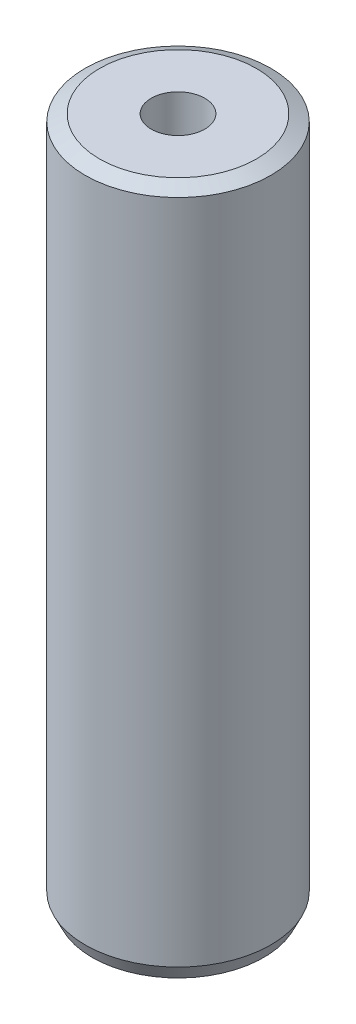
ISO-10303-21;
HEADER;
FILE_DESCRIPTION(('STEP AP214'),'2;1');
FILE_NAME('part.step','',(''),(''),'','','');
FILE_SCHEMA(('AUTOMOTIVE_DESIGN { 1 0 10303 214 1 1 1 1 }'));
ENDSEC;
DATA;
#1=APPLICATION_CONTEXT('core data for automotive mechanical design processes');
#2=APPLICATION_PROTOCOL_DEFINITION('international standard','automotive_design',2000,#1);
#3=PRODUCT_CONTEXT('',#1,'mechanical');
#4=PRODUCT('Part','Part','',(#3));
#5=PRODUCT_RELATED_PRODUCT_CATEGORY('part','',(#4));
#6=PRODUCT_DEFINITION_FORMATION('','',#4);
#7=PRODUCT_DEFINITION_CONTEXT('part definition',#1,'design');
#8=PRODUCT_DEFINITION('design','',#6,#7);
#9=PRODUCT_DEFINITION_SHAPE('','',#8);
#10=(LENGTH_UNIT() NAMED_UNIT(*) SI_UNIT(.MILLI.,.METRE.));
#11=(NAMED_UNIT(*) PLANE_ANGLE_UNIT() SI_UNIT($,.RADIAN.));
#12=(NAMED_UNIT(*) SI_UNIT($,.STERADIAN.) SOLID_ANGLE_UNIT());
#13=UNCERTAINTY_MEASURE_WITH_UNIT(LENGTH_MEASURE(1.E-05),#10,'distance_accuracy_value','');
#14=(GEOMETRIC_REPRESENTATION_CONTEXT(3) GLOBAL_UNCERTAINTY_ASSIGNED_CONTEXT((#13)) GLOBAL_UNIT_ASSIGNED_CONTEXT((#10,
#11,#12)) REPRESENTATION_CONTEXT('',''));
#15=CARTESIAN_POINT('',(0.,0.,0.));
#16=DIRECTION('',(0.,0.,1.));
#17=DIRECTION('',(1.,0.,0.));
#18=AXIS2_PLACEMENT_3D('',#15,#16,#17);
#19=CARTESIAN_POINT('',(0.,92.6308624534081,0.));
#20=DIRECTION('',(0.,-1.,0.));
#21=DIRECTION('',(0.,0.,-1.));
#22=AXIS2_PLACEMENT_3D('',#19,#20,#21);
#23=CYLINDRICAL_SURFACE('',#22,12.5);
#24=CARTESIAN_POINT('',(0.,91.688301292107,0.));
#25=DIRECTION('',(0.,1.,0.));
#26=DIRECTION('',(0.,0.,1.));
#27=AXIS2_PLACEMENT_3D('',#24,#25,#26);
#28=CIRCLE('',#27,12.5);
#29=CARTESIAN_POINT('',(0.,91.688301292107,-12.5));
#30=VERTEX_POINT('',#29);
#31=EDGE_CURVE('E50',#30,#30,#28,.F.);
#32=CARTESIAN_POINT('',(0.,1.93624141101131,0.));
#33=DIRECTION('',(0.,1.,0.));
#34=DIRECTION('',(0.,0.,1.));
#35=AXIS2_PLACEMENT_3D('',#32,#33,#34);
#36=CIRCLE('',#35,12.5);
#37=CARTESIAN_POINT('',(0.,1.9362414110113,-12.5));
#38=VERTEX_POINT('',#37);
#39=EDGE_CURVE('E51',#38,#38,#36,.T.);
#40=CARTESIAN_POINT('',(0.,91.688301292107,-12.5));
#41=CARTESIAN_POINT('',(0.,90.7533840016789,-12.5));
#42=CARTESIAN_POINT('',(0.,89.8184667112508,-12.5));
#43=CARTESIAN_POINT('',(0.,87.9486321303947,-12.5));
#44=CARTESIAN_POINT('',(0.,87.0137148399666,-12.5));
#45=CARTESIAN_POINT('',(0.,85.1438802591104,-12.5));
#46=CARTESIAN_POINT('',(0.,84.2089629686823,-12.5));
#47=CARTESIAN_POINT('',(0.,82.3391283878262,-12.5));
#48=CARTESIAN_POINT('',(0.,81.4042110973981,-12.5));
#49=CARTESIAN_POINT('',(0.,79.5343765165419,-12.5));
#50=CARTESIAN_POINT('',(0.,78.5994592261139,-12.5));
#51=CARTESIAN_POINT('',(0.,76.7296246452577,-12.5));
#52=CARTESIAN_POINT('',(0.,75.7947073548296,-12.5));
#53=CARTESIAN_POINT('',(0.,73.9248727739735,-12.5));
#54=CARTESIAN_POINT('',(0.,72.9899554835454,-12.5));
#55=CARTESIAN_POINT('',(0.,71.1201209026892,-12.5));
#56=CARTESIAN_POINT('',(0.,70.1852036122611,-12.5));
#57=CARTESIAN_POINT('',(0.,68.315369031405,-12.5));
#58=CARTESIAN_POINT('',(0.,67.3804517409769,-12.5));
#59=CARTESIAN_POINT('',(0.,65.5106171601207,-12.5));
#60=CARTESIAN_POINT('',(0.,64.5756998696927,-12.5));
#61=CARTESIAN_POINT('',(0.,62.7058652888365,-12.5));
#62=CARTESIAN_POINT('',(0.,61.7709479984084,-12.5));
#63=CARTESIAN_POINT('',(0.,59.9011134175523,-12.5));
#64=CARTESIAN_POINT('',(0.,58.9661961271242,-12.5));
#65=CARTESIAN_POINT('',(0.,57.096361546268,-12.5));
#66=CARTESIAN_POINT('',(0.,56.1614442558399,-12.5));
#67=CARTESIAN_POINT('',(0.,54.2916096749838,-12.5));
#68=CARTESIAN_POINT('',(0.,53.3566923845557,-12.5));
#69=CARTESIAN_POINT('',(0.,51.4868578036995,-12.5));
#70=CARTESIAN_POINT('',(0.,50.5519405132715,-12.5));
#71=CARTESIAN_POINT('',(0.,48.6821059324153,-12.5));
#72=CARTESIAN_POINT('',(0.,47.7471886419872,-12.5));
#73=CARTESIAN_POINT('',(0.,45.8773540611311,-12.5));
#74=CARTESIAN_POINT('',(0.,44.942436770703,-12.5));
#75=CARTESIAN_POINT('',(0.,43.0726021898468,-12.5));
#76=CARTESIAN_POINT('',(0.,42.1376848994187,-12.5));
#77=CARTESIAN_POINT('',(0.,40.2678503185626,-12.5));
#78=CARTESIAN_POINT('',(0.,39.3329330281345,-12.5));
#79=CARTESIAN_POINT('',(0.,37.4630984472783,-12.5));
#80=CARTESIAN_POINT('',(0.,36.5281811568503,-12.5));
#81=CARTESIAN_POINT('',(0.,34.6583465759941,-12.5));
#82=CARTESIAN_POINT('',(0.,33.723429285566,-12.5));
#83=CARTESIAN_POINT('',(0.,31.8535947047099,-12.5));
#84=CARTESIAN_POINT('',(0.,30.9186774142818,-12.5));
#85=CARTESIAN_POINT('',(0.,29.0488428334256,-12.5));
#86=CARTESIAN_POINT('',(0.,28.1139255429975,-12.5));
#87=CARTESIAN_POINT('',(0.,26.2440909621414,-12.5));
#88=CARTESIAN_POINT('',(0.,25.3091736717133,-12.5));
#89=CARTESIAN_POINT('',(0.,23.4393390908571,-12.5));
#90=CARTESIAN_POINT('',(0.,22.5044218004291,-12.5));
#91=CARTESIAN_POINT('',(0.,20.6345872195729,-12.5));
#92=CARTESIAN_POINT('',(0.,19.6996699291448,-12.5));
#93=CARTESIAN_POINT('',(0.,17.8298353482887,-12.5));
#94=CARTESIAN_POINT('',(0.,16.8949180578606,-12.5));
#95=CARTESIAN_POINT('',(0.,15.0250834770044,-12.5));
#96=CARTESIAN_POINT('',(0.,14.0901661865763,-12.5));
#97=CARTESIAN_POINT('',(0.,12.2203316057202,-12.5));
#98=CARTESIAN_POINT('',(0.,11.2854143152921,-12.5));
#99=CARTESIAN_POINT('',(0.,9.41557973443594,-12.5));
#100=CARTESIAN_POINT('',(0.,8.48066244400786,-12.5));
#101=CARTESIAN_POINT('',(0.,6.6108278631517,-12.5));
#102=CARTESIAN_POINT('',(0.,5.67591057272362,-12.5));
#103=CARTESIAN_POINT('',(0.,3.80607599186746,-12.5));
#104=CARTESIAN_POINT('',(0.,2.87115870143938,-12.5));
#105=CARTESIAN_POINT('',(0.,1.9362414110113,-12.5));
#106=B_SPLINE_CURVE_WITH_KNOTS('',3,(#40,#41,#42,#43,#44,#45,#46,#47,#48,#49,#50,#51,#52,#53,
#54,#55,#56,#57,#58,#59,#60,#61,#62,#63,#64,#65,#66,#67,#68,#69,#70,#71,#72,#73,#74,#75,#76,#77,
#78,#79,#80,#81,#82,#83,#84,#85,#86,#87,#88,#89,#90,#91,#92,#93,#94,#95,#96,#97,#98,#99,#100,
#101,#102,#103,#104,#105),.UNSPECIFIED.,.F.,.F.,(4,2,2,2,2,2,2,2,2,2,2,2,2,2,2,2,2,2,2,2,2,2,2,
2,2,2,2,2,2,2,2,2,4),(0.,2.80475187128423,5.60950374256847,8.41425561385271,11.2190074851369,
14.0237593564212,16.8285112277054,19.6332630989897,22.4380149702739,25.2427668415581,
28.0475187128424,30.8522705841266,33.6570224554109,36.4617743266951,39.2665261979793,
42.0712780692636,44.8760299405478,47.6807818118321,50.4855336831163,53.2902855544005,
56.0950374256848,58.899789296969,61.7045411682533,64.5092930395375,67.3140449108217,
70.118796782106,72.9235486533902,75.7283005246745,78.5330523959587,81.3378042672429,
84.1425561385272,86.9473080098114,89.7520598810957),.UNSPECIFIED.);
#107=EDGE_CURVE('BSEAM39',#30,#38,#106,.T.);
#108=ORIENTED_EDGE('',*,*,#31,.T.);
#109=ORIENTED_EDGE('',*,*,#39,.T.);
#110=ORIENTED_EDGE('',*,*,#107,.T.);
#111=ORIENTED_EDGE('',*,*,#107,.F.);
#112=EDGE_LOOP('',(#108,#110,#109,#111));
#113=FACE_BOUND('',#112,.T.);
#114=ADVANCED_FACE('F39',(#113),#23,.T.);
#115=CARTESIAN_POINT('',(0.,92.6308624534081,0.));
#116=DIRECTION('',(0.,1.,0.));
#117=DIRECTION('',(0.,0.,1.));
#118=AXIS2_PLACEMENT_3D('',#115,#116,#117);
#119=PLANE('',#118);
#120=CARTESIAN_POINT('',(0.,92.6308624534081,0.));
#121=DIRECTION('',(0.,1.,0.));
#122=DIRECTION('',(0.,0.,1.));
#123=AXIS2_PLACEMENT_3D('',#120,#121,#122);
#124=CIRCLE('',#123,10.563758588989);
#125=CARTESIAN_POINT('',(0.,92.6308624534081,10.563758588989));
#126=VERTEX_POINT('',#125);
#127=EDGE_CURVE('E54',#126,#126,#124,.T.);
#128=ORIENTED_EDGE('',*,*,#127,.T.);
#129=EDGE_LOOP('',(#128));
#130=FACE_BOUND('',#129,.T.);
#131=CARTESIAN_POINT('',(0.,92.6308624534081,0.));
#132=DIRECTION('',(0.,1.,0.));
#133=DIRECTION('',(0.,0.,1.));
#134=AXIS2_PLACEMENT_3D('',#131,#132,#133);
#135=CIRCLE('',#134,3.61154254292769);
#136=CARTESIAN_POINT('',(0.,92.6308624534081,-3.61154254292769));
#137=VERTEX_POINT('',#136);
#138=EDGE_CURVE('E58',#137,#137,#135,.T.);
#139=ORIENTED_EDGE('',*,*,#138,.F.);
#140=EDGE_LOOP('',(#139));
#141=FACE_BOUND('',#140,.T.);
#142=ADVANCED_FACE('F69',(#130,#141),#119,.T.);
#143=CARTESIAN_POINT('',(0.,0.,0.));
#144=DIRECTION('',(0.,1.,0.));
#145=DIRECTION('',(0.,0.,1.));
#146=AXIS2_PLACEMENT_3D('',#143,#144,#145);
#147=PLANE('',#146);
#148=CARTESIAN_POINT('',(0.,0.,0.));
#149=DIRECTION('',(0.,1.,0.));
#150=DIRECTION('',(0.,0.,1.));
#151=AXIS2_PLACEMENT_3D('',#148,#149,#150);
#152=CIRCLE('',#151,11.5574388386988);
#153=CARTESIAN_POINT('',(0.,0.,11.5574388386988));
#154=VERTEX_POINT('',#153);
#155=EDGE_CURVE('E10',#154,#154,#152,.F.);
#156=ORIENTED_EDGE('',*,*,#155,.T.);
#157=EDGE_LOOP('',(#156));
#158=FACE_BOUND('',#157,.T.);
#159=CARTESIAN_POINT('',(0.,0.,0.));
#160=DIRECTION('',(0.,1.,0.));
#161=DIRECTION('',(0.,0.,1.));
#162=AXIS2_PLACEMENT_3D('',#159,#160,#161);
#163=CIRCLE('',#162,3.61154254292769);
#164=CARTESIAN_POINT('',(0.,0.,-3.61154254292769));
#165=VERTEX_POINT('',#164);
#166=EDGE_CURVE('E63',#165,#165,#163,.T.);
#167=ORIENTED_EDGE('',*,*,#166,.T.);
#168=EDGE_LOOP('',(#167));
#169=FACE_BOUND('',#168,.T.);
#170=ADVANCED_FACE('F75',(#158,#169),#147,.F.);
#171=CARTESIAN_POINT('',(0.,92.6308624534081,0.));
#172=DIRECTION('',(0.,-1.,0.));
#173=DIRECTION('',(0.,0.,-1.));
#174=AXIS2_PLACEMENT_3D('',#171,#172,#173);
#175=CYLINDRICAL_SURFACE('',#174,3.61154254292769);
#176=CARTESIAN_POINT('',(0.,92.6308624534081,-3.61154254292769));
#177=CARTESIAN_POINT('',(0.,91.6659576361851,-3.61154254292769));
#178=CARTESIAN_POINT('',(0.,90.7010528189621,-3.61154254292769));
#179=CARTESIAN_POINT('',(0.,88.7712431845161,-3.61154254292769));
#180=CARTESIAN_POINT('',(0.,87.8063383672931,-3.61154254292769));
#181=CARTESIAN_POINT('',(0.,85.876528732847,-3.61154254292769));
#182=CARTESIAN_POINT('',(0.,84.911623915624,-3.61154254292769));
#183=CARTESIAN_POINT('',(0.,82.9818142811781,-3.61154254292769));
#184=CARTESIAN_POINT('',(0.,82.0169094639551,-3.61154254292769));
#185=CARTESIAN_POINT('',(0.,80.0870998295091,-3.61154254292769));
#186=CARTESIAN_POINT('',(0.,79.1221950122861,-3.61154254292769));
#187=CARTESIAN_POINT('',(0.,77.1923853778401,-3.61154254292769));
#188=CARTESIAN_POINT('',(0.,76.2274805606171,-3.61154254292769));
#189=CARTESIAN_POINT('',(0.,74.2976709261711,-3.61154254292769));
#190=CARTESIAN_POINT('',(0.,73.332766108948,-3.61154254292769));
#191=CARTESIAN_POINT('',(0.,71.402956474502,-3.61154254292769));
#192=CARTESIAN_POINT('',(0.,70.438051657279,-3.61154254292769));
#193=CARTESIAN_POINT('',(0.,68.508242022833,-3.61154254292769));
#194=CARTESIAN_POINT('',(0.,67.54333720561,-3.61154254292769));
#195=CARTESIAN_POINT('',(0.,65.613527571164,-3.61154254292769));
#196=CARTESIAN_POINT('',(0.,64.648622753941,-3.61154254292769));
#197=CARTESIAN_POINT('',(0.,62.718813119495,-3.61154254292769));
#198=CARTESIAN_POINT('',(0.,61.753908302272,-3.61154254292769));
#199=CARTESIAN_POINT('',(0.,59.824098667826,-3.61154254292769));
#200=CARTESIAN_POINT('',(0.,58.859193850603,-3.61154254292769));
#201=CARTESIAN_POINT('',(0.,56.929384216157,-3.61154254292769));
#202=CARTESIAN_POINT('',(0.,55.964479398934,-3.61154254292769));
#203=CARTESIAN_POINT('',(0.,54.034669764488,-3.61154254292769));
#204=CARTESIAN_POINT('',(0.,53.069764947265,-3.61154254292769));
#205=CARTESIAN_POINT('',(0.,51.139955312819,-3.61154254292769));
#206=CARTESIAN_POINT('',(0.,50.175050495596,-3.61154254292769));
#207=CARTESIAN_POINT('',(0.,48.24524086115,-3.61154254292769));
#208=CARTESIAN_POINT('',(0.,47.280336043927,-3.61154254292769));
#209=CARTESIAN_POINT('',(0.,45.350526409481,-3.61154254292769));
#210=CARTESIAN_POINT('',(0.,44.385621592258,-3.61154254292769));
#211=CARTESIAN_POINT('',(0.,42.455811957812,-3.61154254292769));
#212=CARTESIAN_POINT('',(0.,41.490907140589,-3.61154254292769));
#213=CARTESIAN_POINT('',(0.,39.561097506143,-3.61154254292769));
#214=CARTESIAN_POINT('',(0.,38.59619268892,-3.61154254292769));
#215=CARTESIAN_POINT('',(0.,36.666383054474,-3.61154254292769));
#216=CARTESIAN_POINT('',(0.,35.701478237251,-3.61154254292769));
#217=CARTESIAN_POINT('',(0.,33.771668602805,-3.61154254292769));
#218=CARTESIAN_POINT('',(0.,32.806763785582,-3.61154254292769));
#219=CARTESIAN_POINT('',(0.,30.876954151136,-3.61154254292769));
#220=CARTESIAN_POINT('',(0.,29.912049333913,-3.61154254292769));
#221=CARTESIAN_POINT('',(0.,27.982239699467,-3.61154254292769));
#222=CARTESIAN_POINT('',(0.,27.017334882244,-3.61154254292769));
#223=CARTESIAN_POINT('',(0.,25.087525247798,-3.61154254292769));
#224=CARTESIAN_POINT('',(0.,24.122620430575,-3.61154254292769));
#225=CARTESIAN_POINT('',(0.,22.192810796129,-3.61154254292769));
#226=CARTESIAN_POINT('',(0.,21.227905978906,-3.61154254292769));
#227=CARTESIAN_POINT('',(0.,19.29809634446,-3.61154254292769));
#228=CARTESIAN_POINT('',(0.,18.333191527237,-3.61154254292769));
#229=CARTESIAN_POINT('',(0.,16.403381892791,-3.61154254292769));
#230=CARTESIAN_POINT('',(0.,15.438477075568,-3.61154254292769));
#231=CARTESIAN_POINT('',(0.,13.508667441122,-3.61154254292769));
#232=CARTESIAN_POINT('',(0.,12.543762623899,-3.61154254292769));
#233=CARTESIAN_POINT('',(0.,10.613952989453,-3.61154254292769));
#234=CARTESIAN_POINT('',(0.,9.64904817223,-3.61154254292769));
#235=CARTESIAN_POINT('',(0.,7.719238537784,-3.61154254292769));
#236=CARTESIAN_POINT('',(0.,6.75433372056099,-3.61154254292769));
#237=CARTESIAN_POINT('',(0.,4.82452408611499,-3.61154254292769));
#238=CARTESIAN_POINT('',(0.,3.85961926889199,-3.61154254292769));
#239=CARTESIAN_POINT('',(0.,1.92980963444599,-3.61154254292769));
#240=CARTESIAN_POINT('',(0.,0.964904817222987,-3.61154254292769));
#241=CARTESIAN_POINT('',(0.,0.,-3.61154254292769));
#242=B_SPLINE_CURVE_WITH_KNOTS('',3,(#176,#177,#178,#179,#180,#181,#182,#183,#184,#185,#186,
#187,#188,#189,#190,#191,#192,#193,#194,#195,#196,#197,#198,#199,#200,#201,#202,#203,#204,#205,
#206,#207,#208,#209,#210,#211,#212,#213,#214,#215,#216,#217,#218,#219,#220,#221,#222,#223,#224,
#225,#226,#227,#228,#229,#230,#231,#232,#233,#234,#235,#236,#237,#238,#239,#240,#241),
.UNSPECIFIED.,.F.,.F.,(4,2,2,2,2,2,2,2,2,2,2,2,2,2,2,2,2,2,2,2,2,2,2,2,2,2,2,2,2,2,2,2,4),(0.,
2.89471445166901,5.78942890333802,8.68414335500701,11.578857806676,14.473572258345,
17.368286710014,20.263001161683,23.157715613352,26.052430065021,28.94714451669,31.841858968359,
34.736573420028,37.631287871697,40.526002323366,43.420716775035,46.315431226704,49.210145678373,
52.1048601300421,54.9995745817111,57.8942890333801,60.7890034850491,63.6837179367181,
66.5784323883871,69.473146840056,72.3678612917251,75.2625757433941,78.1572901950631,
81.0520046467321,83.9467190984011,86.8414335500701,89.7361480017391,92.6308624534081),.UNSPECIFIED.);
#243=EDGE_CURVE('BSEAM70',#137,#165,#242,.T.);
#244=ORIENTED_EDGE('',*,*,#138,.T.);
#245=ORIENTED_EDGE('',*,*,#166,.F.);
#246=ORIENTED_EDGE('',*,*,#243,.T.);
#247=ORIENTED_EDGE('',*,*,#243,.F.);
#248=EDGE_LOOP('',(#244,#246,#245,#247));
#249=FACE_BOUND('',#248,.T.);
#250=ADVANCED_FACE('F70',(#249),#175,.F.);
#251=CARTESIAN_POINT('',(0.,92.6308624534081,0.));
#252=DIRECTION('',(0.,-1.,0.));
#253=DIRECTION('',(0.,0.,-1.));
#254=AXIS2_PLACEMENT_3D('',#251,#252,#253);
#255=CONICAL_SURFACE('',#254,10.563758588989,1.11776485508324);
#256=ORIENTED_EDGE('',*,*,#31,.F.);
#257=EDGE_LOOP('',(#256));
#258=FACE_BOUND('',#257,.T.);
#259=ORIENTED_EDGE('',*,*,#127,.F.);
#260=EDGE_LOOP('',(#259));
#261=FACE_BOUND('',#260,.T.);
#262=ADVANCED_FACE('F81',(#258,#261),#255,.T.);
#263=CARTESIAN_POINT('',(0.,1.93624141101131,0.));
#264=DIRECTION('',(0.,1.,0.));
#265=DIRECTION('',(0.,0.,1.));
#266=AXIS2_PLACEMENT_3D('',#263,#264,#265);
#267=CONICAL_SURFACE('',#266,12.5,0.453031471711657);
#268=ORIENTED_EDGE('',*,*,#155,.F.);
#269=EDGE_LOOP('',(#268));
#270=FACE_BOUND('',#269,.T.);
#271=ORIENTED_EDGE('',*,*,#39,.F.);
#272=EDGE_LOOP('',(#271));
#273=FACE_BOUND('',#272,.T.);
#274=ADVANCED_FACE('F45',(#270,#273),#267,.T.);
#275=CLOSED_SHELL('',(#114,#142,#170,#250,#262,#274));
#276=MANIFOLD_SOLID_BREP('B2',#275);
#277=ADVANCED_BREP_SHAPE_REPRESENTATION('',(#18,#276),#14);
#278=SHAPE_DEFINITION_REPRESENTATION(#9,#277);
ENDSEC;
END-ISO-10303-21;
